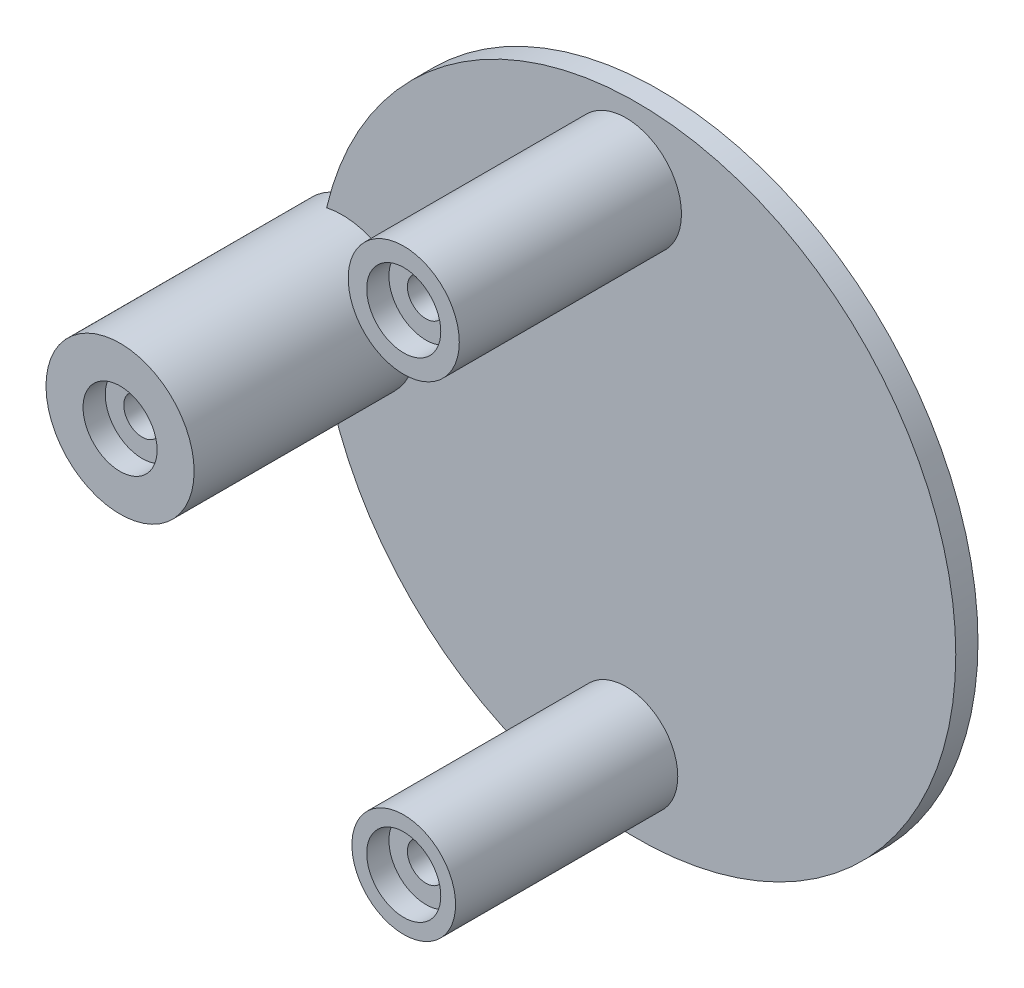
ISO-10303-21;
HEADER;
FILE_DESCRIPTION(('STEP AP214'),'2;1');
FILE_NAME('part.step','',(''),(''),'','','');
FILE_SCHEMA(('AUTOMOTIVE_DESIGN { 1 0 10303 214 1 1 1 1 }'));
ENDSEC;
DATA;
#1=APPLICATION_CONTEXT('core data for automotive mechanical design processes');
#2=APPLICATION_PROTOCOL_DEFINITION('international standard','automotive_design',2000,#1);
#3=PRODUCT_CONTEXT('',#1,'mechanical');
#4=PRODUCT('Part','Part','',(#3));
#5=PRODUCT_RELATED_PRODUCT_CATEGORY('part','',(#4));
#6=PRODUCT_DEFINITION_FORMATION('','',#4);
#7=PRODUCT_DEFINITION_CONTEXT('part definition',#1,'design');
#8=PRODUCT_DEFINITION('design','',#6,#7);
#9=PRODUCT_DEFINITION_SHAPE('','',#8);
#10=(LENGTH_UNIT() NAMED_UNIT(*) SI_UNIT(.MILLI.,.METRE.));
#11=(NAMED_UNIT(*) PLANE_ANGLE_UNIT() SI_UNIT($,.RADIAN.));
#12=(NAMED_UNIT(*) SI_UNIT($,.STERADIAN.) SOLID_ANGLE_UNIT());
#13=UNCERTAINTY_MEASURE_WITH_UNIT(LENGTH_MEASURE(1.E-05),#10,'distance_accuracy_value','');
#14=(GEOMETRIC_REPRESENTATION_CONTEXT(3) GLOBAL_UNCERTAINTY_ASSIGNED_CONTEXT((#13)) GLOBAL_UNIT_ASSIGNED_CONTEXT((#10,
#11,#12)) REPRESENTATION_CONTEXT('',''));
#15=CARTESIAN_POINT('',(0.,0.,0.));
#16=DIRECTION('',(0.,0.,1.));
#17=DIRECTION('',(1.,0.,0.));
#18=AXIS2_PLACEMENT_3D('',#15,#16,#17);
#19=CARTESIAN_POINT('',(29.,78.,0.));
#20=DIRECTION('',(0.,0.,-1.));
#21=DIRECTION('',(1.,0.,0.));
#22=AXIS2_PLACEMENT_3D('',#19,#20,#21);
#23=PLANE('',#22);
#24=CARTESIAN_POINT('',(29.,78.,0.));
#25=DIRECTION('',(0.,0.,1.));
#26=DIRECTION('',(1.,0.,0.));
#27=AXIS2_PLACEMENT_3D('',#24,#25,#26);
#28=CIRCLE('',#27,7.5);
#29=CARTESIAN_POINT('',(36.5,78.,0.));
#30=VERTEX_POINT('',#29);
#31=EDGE_CURVE('E79',#30,#30,#28,.T.);
#32=ORIENTED_EDGE('',*,*,#31,.T.);
#33=EDGE_LOOP('',(#32));
#34=FACE_BOUND('',#33,.T.);
#35=CARTESIAN_POINT('',(29.,78.,0.));
#36=DIRECTION('',(0.,0.,1.));
#37=DIRECTION('',(1.,0.,0.));
#38=AXIS2_PLACEMENT_3D('',#35,#36,#37);
#39=CIRCLE('',#38,5.);
#40=CARTESIAN_POINT('',(34.,78.,0.));
#41=VERTEX_POINT('',#40);
#42=EDGE_CURVE('E92',#41,#41,#39,.T.);
#43=ORIENTED_EDGE('',*,*,#42,.F.);
#44=EDGE_LOOP('',(#43));
#45=FACE_BOUND('',#44,.T.);
#46=ADVANCED_FACE('F37',(#34,#45),#23,.F.);
#47=CARTESIAN_POINT('',(29.,78.,-3.));
#48=DIRECTION('',(0.,0.,1.));
#49=DIRECTION('',(-1.,0.,0.));
#50=AXIS2_PLACEMENT_3D('',#47,#48,#49);
#51=CYLINDRICAL_SURFACE('',#50,7.5);
#52=ORIENTED_EDGE('',*,*,#31,.F.);
#53=EDGE_LOOP('',(#52));
#54=FACE_BOUND('',#53,.T.);
#55=CARTESIAN_POINT('',(29.,78.,-30.));
#56=DIRECTION('',(0.,0.,1.));
#57=DIRECTION('',(1.,0.,0.));
#58=AXIS2_PLACEMENT_3D('',#55,#56,#57);
#59=CIRCLE('',#58,7.5);
#60=CARTESIAN_POINT('',(36.5,78.,-30.));
#61=VERTEX_POINT('',#60);
#62=EDGE_CURVE('E83',#61,#61,#59,.T.);
#63=ORIENTED_EDGE('',*,*,#62,.T.);
#64=EDGE_LOOP('',(#63));
#65=FACE_BOUND('',#64,.T.);
#66=ADVANCED_FACE('F39',(#54,#65),#51,.T.);
#67=CARTESIAN_POINT('',(29.,78.,-3.));
#68=DIRECTION('',(0.,0.,1.));
#69=DIRECTION('',(-1.,0.,0.));
#70=AXIS2_PLACEMENT_3D('',#67,#68,#69);
#71=CYLINDRICAL_SURFACE('',#70,5.);
#72=CARTESIAN_POINT('',(29.,78.,-3.));
#73=DIRECTION('',(0.,0.,1.));
#74=DIRECTION('',(1.,0.,0.));
#75=AXIS2_PLACEMENT_3D('',#72,#73,#74);
#76=CIRCLE('',#75,5.);
#77=CARTESIAN_POINT('',(34.,78.,-3.));
#78=VERTEX_POINT('',#77);
#79=EDGE_CURVE('E89',#78,#78,#76,.T.);
#80=ORIENTED_EDGE('',*,*,#79,.F.);
#81=EDGE_LOOP('',(#80));
#82=FACE_BOUND('',#81,.T.);
#83=ORIENTED_EDGE('',*,*,#42,.T.);
#84=EDGE_LOOP('',(#83));
#85=FACE_BOUND('',#84,.T.);
#86=ADVANCED_FACE('F152',(#82,#85),#71,.F.);
#87=CARTESIAN_POINT('',(29.,78.,-3.));
#88=DIRECTION('',(0.,0.,-1.));
#89=DIRECTION('',(1.,0.,0.));
#90=AXIS2_PLACEMENT_3D('',#87,#88,#89);
#91=PLANE('',#90);
#92=CARTESIAN_POINT('',(29.,78.,-3.));
#93=DIRECTION('',(0.,0.,1.));
#94=DIRECTION('',(1.,0.,0.));
#95=AXIS2_PLACEMENT_3D('',#92,#93,#94);
#96=CIRCLE('',#95,2.5);
#97=CARTESIAN_POINT('',(31.5,78.,-3.));
#98=VERTEX_POINT('',#97);
#99=EDGE_CURVE('E102',#98,#98,#96,.T.);
#100=ORIENTED_EDGE('',*,*,#99,.F.);
#101=EDGE_LOOP('',(#100));
#102=FACE_BOUND('',#101,.T.);
#103=ORIENTED_EDGE('',*,*,#79,.T.);
#104=EDGE_LOOP('',(#103));
#105=FACE_BOUND('',#104,.T.);
#106=ADVANCED_FACE('F158',(#102,#105),#91,.F.);
#107=CARTESIAN_POINT('',(-9.29999999999999,45.,-33.));
#108=DIRECTION('',(0.,0.,1.));
#109=DIRECTION('',(-1.,0.,0.));
#110=AXIS2_PLACEMENT_3D('',#107,#108,#109);
#111=CYLINDRICAL_SURFACE('',#110,10.);
#112=DIRECTION('',(0.,0.,1.));
#113=VECTOR('',#112,1.);
#114=CARTESIAN_POINT('',(-11.4091892759593,54.7750355804048,-33.));
#115=LINE('',#114,#113);
#116=CARTESIAN_POINT('',(-11.4091892759593,54.7750355804048,-33.));
#117=VERTEX_POINT('',#116);
#118=CARTESIAN_POINT('',(-11.4091892759593,54.7750355804048,-30.));
#119=VERTEX_POINT('',#118);
#120=EDGE_CURVE('E77',#117,#119,#115,.T.);
#121=ORIENTED_EDGE('',*,*,#120,.F.);
#122=CARTESIAN_POINT('',(-9.29999999999999,45.,-33.));
#123=DIRECTION('',(0.,0.,1.));
#124=DIRECTION('',(1.,0.,0.));
#125=AXIS2_PLACEMENT_3D('',#122,#123,#124);
#126=CIRCLE('',#125,10.);
#127=CARTESIAN_POINT('',(-11.4091892759592,35.2249644195953,-33.));
#128=VERTEX_POINT('',#127);
#129=EDGE_CURVE('E69',#117,#128,#126,.T.);
#130=ORIENTED_EDGE('',*,*,#129,.T.);
#131=DIRECTION('',(0.,0.,1.));
#132=VECTOR('',#131,1.);
#133=CARTESIAN_POINT('',(-11.4091892759592,35.2249644195953,-33.));
#134=LINE('',#133,#132);
#135=CARTESIAN_POINT('',(-11.4091892759592,35.2249644195953,-30.));
#136=VERTEX_POINT('',#135);
#137=EDGE_CURVE('E78',#128,#136,#134,.T.);
#138=ORIENTED_EDGE('',*,*,#137,.T.);
#139=CARTESIAN_POINT('',(-9.29999999999999,45.,-30.));
#140=DIRECTION('',(0.,0.,1.));
#141=DIRECTION('',(1.,0.,0.));
#142=AXIS2_PLACEMENT_3D('',#139,#140,#141);
#143=CIRCLE('',#142,9.99999999999999);
#144=EDGE_CURVE('E47',#119,#136,#143,.F.);
#145=ORIENTED_EDGE('',*,*,#144,.F.);
#146=EDGE_LOOP('',(#121,#130,#138,#145));
#147=FACE_BOUND('',#146,.T.);
#148=CARTESIAN_POINT('',(-9.29999999999999,45.,0.));
#149=DIRECTION('',(0.,0.,1.));
#150=DIRECTION('',(1.,0.,0.));
#151=AXIS2_PLACEMENT_3D('',#148,#149,#150);
#152=CIRCLE('',#151,9.99999999999999);
#153=CARTESIAN_POINT('',(0.700000000000004,45.,0.));
#154=VERTEX_POINT('',#153);
#155=EDGE_CURVE('E70',#154,#154,#152,.T.);
#156=ORIENTED_EDGE('',*,*,#155,.F.);
#157=EDGE_LOOP('',(#156));
#158=FACE_BOUND('',#157,.T.);
#159=ADVANCED_FACE('F74',(#147,#158),#111,.T.);
#160=CARTESIAN_POINT('',(30.5,45.,-33.));
#161=DIRECTION('',(0.,0.,1.));
#162=DIRECTION('',(-1.,0.,0.));
#163=AXIS2_PLACEMENT_3D('',#160,#161,#162);
#164=CYLINDRICAL_SURFACE('',#163,43.0340733183179);
#165=CARTESIAN_POINT('',(30.5,45.,-30.));
#166=DIRECTION('',(0.,0.,1.));
#167=DIRECTION('',(1.,0.,0.));
#168=AXIS2_PLACEMENT_3D('',#165,#166,#167);
#169=CIRCLE('',#168,43.0340733183179);
#170=EDGE_CURVE('E62',#136,#119,#169,.T.);
#171=ORIENTED_EDGE('',*,*,#170,.F.);
#172=ORIENTED_EDGE('',*,*,#137,.F.);
#173=CARTESIAN_POINT('',(30.5,45.,-33.));
#174=DIRECTION('',(0.,0.,1.));
#175=DIRECTION('',(1.,0.,0.));
#176=AXIS2_PLACEMENT_3D('',#173,#174,#175);
#177=CIRCLE('',#176,43.0340733183179);
#178=EDGE_CURVE('E55',#128,#117,#177,.T.);
#179=ORIENTED_EDGE('',*,*,#178,.T.);
#180=ORIENTED_EDGE('',*,*,#120,.T.);
#181=EDGE_LOOP('',(#171,#172,#179,#180));
#182=FACE_BOUND('',#181,.T.);
#183=ADVANCED_FACE('F81',(#182),#164,.T.);
#184=CARTESIAN_POINT('',(10.6,45.,-33.));
#185=DIRECTION('',(0.,0.,-1.));
#186=DIRECTION('',(1.,0.,0.));
#187=AXIS2_PLACEMENT_3D('',#184,#185,#186);
#188=PLANE('',#187);
#189=CARTESIAN_POINT('',(-9.29999999999999,45.,-33.));
#190=DIRECTION('',(0.,0.,1.));
#191=DIRECTION('',(1.,0.,0.));
#192=AXIS2_PLACEMENT_3D('',#189,#190,#191);
#193=CIRCLE('',#192,2.5);
#194=CARTESIAN_POINT('',(-6.79999999999999,45.,-33.));
#195=VERTEX_POINT('',#194);
#196=EDGE_CURVE('E98',#195,#195,#193,.T.);
#197=ORIENTED_EDGE('',*,*,#196,.T.);
#198=EDGE_LOOP('',(#197));
#199=FACE_BOUND('',#198,.T.);
#200=CARTESIAN_POINT('',(29.,12.,-33.));
#201=DIRECTION('',(0.,0.,1.));
#202=DIRECTION('',(1.,0.,0.));
#203=AXIS2_PLACEMENT_3D('',#200,#201,#202);
#204=CIRCLE('',#203,2.5);
#205=CARTESIAN_POINT('',(31.5,12.,-33.));
#206=VERTEX_POINT('',#205);
#207=EDGE_CURVE('E104',#206,#206,#204,.T.);
#208=ORIENTED_EDGE('',*,*,#207,.T.);
#209=EDGE_LOOP('',(#208));
#210=FACE_BOUND('',#209,.T.);
#211=CARTESIAN_POINT('',(29.,78.,-33.));
#212=DIRECTION('',(0.,0.,1.));
#213=DIRECTION('',(1.,0.,0.));
#214=AXIS2_PLACEMENT_3D('',#211,#212,#213);
#215=CIRCLE('',#214,2.5);
#216=CARTESIAN_POINT('',(31.5,78.,-33.));
#217=VERTEX_POINT('',#216);
#218=EDGE_CURVE('E109',#217,#217,#215,.T.);
#219=ORIENTED_EDGE('',*,*,#218,.T.);
#220=EDGE_LOOP('',(#219));
#221=FACE_BOUND('',#220,.T.);
#222=ORIENTED_EDGE('',*,*,#129,.F.);
#223=ORIENTED_EDGE('',*,*,#178,.F.);
#224=EDGE_LOOP('',(#222,#223));
#225=FACE_BOUND('',#224,.T.);
#226=ADVANCED_FACE('F134',(#199,#210,#221,#225),#188,.T.);
#227=CARTESIAN_POINT('',(10.6,45.,-30.));
#228=DIRECTION('',(0.,0.,-1.));
#229=DIRECTION('',(1.,0.,0.));
#230=AXIS2_PLACEMENT_3D('',#227,#228,#229);
#231=PLANE('',#230);
#232=CARTESIAN_POINT('',(29.,12.,-30.));
#233=DIRECTION('',(0.,0.,1.));
#234=DIRECTION('',(1.,0.,0.));
#235=AXIS2_PLACEMENT_3D('',#232,#233,#234);
#236=CIRCLE('',#235,7.);
#237=CARTESIAN_POINT('',(36.,12.,-30.));
#238=VERTEX_POINT('',#237);
#239=EDGE_CURVE('E11',#238,#238,#236,.F.);
#240=ORIENTED_EDGE('',*,*,#239,.T.);
#241=EDGE_LOOP('',(#240));
#242=FACE_BOUND('',#241,.T.);
#243=ORIENTED_EDGE('',*,*,#144,.T.);
#244=ORIENTED_EDGE('',*,*,#170,.T.);
#245=EDGE_LOOP('',(#243,#244));
#246=FACE_BOUND('',#245,.T.);
#247=ORIENTED_EDGE('',*,*,#62,.F.);
#248=EDGE_LOOP('',(#247));
#249=FACE_BOUND('',#248,.T.);
#250=ADVANCED_FACE('F66',(#242,#246,#249),#231,.F.);
#251=CARTESIAN_POINT('',(-9.29999999999999,45.,0.));
#252=DIRECTION('',(0.,0.,-1.));
#253=DIRECTION('',(1.,0.,0.));
#254=AXIS2_PLACEMENT_3D('',#251,#252,#253);
#255=PLANE('',#254);
#256=ORIENTED_EDGE('',*,*,#155,.T.);
#257=EDGE_LOOP('',(#256));
#258=FACE_BOUND('',#257,.T.);
#259=CARTESIAN_POINT('',(-9.29999999999999,45.,0.));
#260=DIRECTION('',(0.,0.,1.));
#261=DIRECTION('',(1.,0.,0.));
#262=AXIS2_PLACEMENT_3D('',#259,#260,#261);
#263=CIRCLE('',#262,5.);
#264=CARTESIAN_POINT('',(-4.29999999999999,45.,0.));
#265=VERTEX_POINT('',#264);
#266=EDGE_CURVE('E128',#265,#265,#263,.T.);
#267=ORIENTED_EDGE('',*,*,#266,.F.);
#268=EDGE_LOOP('',(#267));
#269=FACE_BOUND('',#268,.T.);
#270=ADVANCED_FACE('F141',(#258,#269),#255,.F.);
#271=CARTESIAN_POINT('',(-9.29999999999999,45.,-3.));
#272=DIRECTION('',(0.,0.,1.));
#273=DIRECTION('',(-1.,0.,0.));
#274=AXIS2_PLACEMENT_3D('',#271,#272,#273);
#275=CYLINDRICAL_SURFACE('',#274,5.);
#276=CARTESIAN_POINT('',(-9.29999999999999,45.,-3.));
#277=DIRECTION('',(0.,0.,1.));
#278=DIRECTION('',(1.,0.,0.));
#279=AXIS2_PLACEMENT_3D('',#276,#277,#278);
#280=CIRCLE('',#279,5.);
#281=CARTESIAN_POINT('',(-4.29999999999999,45.,-3.));
#282=VERTEX_POINT('',#281);
#283=EDGE_CURVE('E125',#282,#282,#280,.T.);
#284=ORIENTED_EDGE('',*,*,#283,.F.);
#285=EDGE_LOOP('',(#284));
#286=FACE_BOUND('',#285,.T.);
#287=ORIENTED_EDGE('',*,*,#266,.T.);
#288=EDGE_LOOP('',(#287));
#289=FACE_BOUND('',#288,.T.);
#290=ADVANCED_FACE('F191',(#286,#289),#275,.F.);
#291=CARTESIAN_POINT('',(-9.29999999999999,45.,-3.));
#292=DIRECTION('',(0.,0.,-1.));
#293=DIRECTION('',(1.,0.,0.));
#294=AXIS2_PLACEMENT_3D('',#291,#292,#293);
#295=PLANE('',#294);
#296=CARTESIAN_POINT('',(-9.29999999999999,45.,-3.));
#297=DIRECTION('',(0.,0.,1.));
#298=DIRECTION('',(1.,0.,0.));
#299=AXIS2_PLACEMENT_3D('',#296,#297,#298);
#300=CIRCLE('',#299,2.5);
#301=CARTESIAN_POINT('',(-6.79999999999999,45.,-3.));
#302=VERTEX_POINT('',#301);
#303=EDGE_CURVE('E41',#302,#302,#300,.T.);
#304=ORIENTED_EDGE('',*,*,#303,.F.);
#305=EDGE_LOOP('',(#304));
#306=FACE_BOUND('',#305,.T.);
#307=ORIENTED_EDGE('',*,*,#283,.T.);
#308=EDGE_LOOP('',(#307));
#309=FACE_BOUND('',#308,.T.);
#310=ADVANCED_FACE('F200',(#306,#309),#295,.F.);
#311=CARTESIAN_POINT('',(29.,12.,0.));
#312=DIRECTION('',(0.,0.,-1.));
#313=DIRECTION('',(1.,0.,0.));
#314=AXIS2_PLACEMENT_3D('',#311,#312,#313);
#315=PLANE('',#314);
#316=CARTESIAN_POINT('',(29.,12.,0.));
#317=DIRECTION('',(0.,0.,1.));
#318=DIRECTION('',(1.,0.,0.));
#319=AXIS2_PLACEMENT_3D('',#316,#317,#318);
#320=CIRCLE('',#319,7.);
#321=CARTESIAN_POINT('',(36.,12.,0.));
#322=VERTEX_POINT('',#321);
#323=EDGE_CURVE('E122',#322,#322,#320,.T.);
#324=ORIENTED_EDGE('',*,*,#323,.T.);
#325=EDGE_LOOP('',(#324));
#326=FACE_BOUND('',#325,.T.);
#327=CARTESIAN_POINT('',(29.,12.,0.));
#328=DIRECTION('',(0.,0.,1.));
#329=DIRECTION('',(1.,0.,0.));
#330=AXIS2_PLACEMENT_3D('',#327,#328,#329);
#331=CIRCLE('',#330,5.);
#332=CARTESIAN_POINT('',(34.,12.,0.));
#333=VERTEX_POINT('',#332);
#334=EDGE_CURVE('E119',#333,#333,#331,.T.);
#335=ORIENTED_EDGE('',*,*,#334,.F.);
#336=EDGE_LOOP('',(#335));
#337=FACE_BOUND('',#336,.T.);
#338=ADVANCED_FACE('F210',(#326,#337),#315,.F.);
#339=CARTESIAN_POINT('',(29.,12.,-3.));
#340=DIRECTION('',(0.,0.,1.));
#341=DIRECTION('',(-1.,0.,0.));
#342=AXIS2_PLACEMENT_3D('',#339,#340,#341);
#343=CYLINDRICAL_SURFACE('',#342,7.);
#344=ORIENTED_EDGE('',*,*,#323,.F.);
#345=EDGE_LOOP('',(#344));
#346=FACE_BOUND('',#345,.T.);
#347=ORIENTED_EDGE('',*,*,#239,.F.);
#348=EDGE_LOOP('',(#347));
#349=FACE_BOUND('',#348,.T.);
#350=ADVANCED_FACE('F220',(#346,#349),#343,.T.);
#351=CARTESIAN_POINT('',(29.,12.,-3.));
#352=DIRECTION('',(0.,0.,1.));
#353=DIRECTION('',(-1.,0.,0.));
#354=AXIS2_PLACEMENT_3D('',#351,#352,#353);
#355=CYLINDRICAL_SURFACE('',#354,5.);
#356=CARTESIAN_POINT('',(29.,12.,-3.));
#357=DIRECTION('',(0.,0.,1.));
#358=DIRECTION('',(1.,0.,0.));
#359=AXIS2_PLACEMENT_3D('',#356,#357,#358);
#360=CIRCLE('',#359,5.);
#361=CARTESIAN_POINT('',(34.,12.,-3.));
#362=VERTEX_POINT('',#361);
#363=EDGE_CURVE('E116',#362,#362,#360,.T.);
#364=ORIENTED_EDGE('',*,*,#363,.F.);
#365=EDGE_LOOP('',(#364));
#366=FACE_BOUND('',#365,.T.);
#367=ORIENTED_EDGE('',*,*,#334,.T.);
#368=EDGE_LOOP('',(#367));
#369=FACE_BOUND('',#368,.T.);
#370=ADVANCED_FACE('F231',(#366,#369),#355,.F.);
#371=CARTESIAN_POINT('',(29.,12.,-3.));
#372=DIRECTION('',(0.,0.,-1.));
#373=DIRECTION('',(1.,0.,0.));
#374=AXIS2_PLACEMENT_3D('',#371,#372,#373);
#375=PLANE('',#374);
#376=CARTESIAN_POINT('',(29.,12.,-3.));
#377=DIRECTION('',(0.,0.,1.));
#378=DIRECTION('',(1.,0.,0.));
#379=AXIS2_PLACEMENT_3D('',#376,#377,#378);
#380=CIRCLE('',#379,2.5);
#381=CARTESIAN_POINT('',(31.5,12.,-3.));
#382=VERTEX_POINT('',#381);
#383=EDGE_CURVE('E96',#382,#382,#380,.T.);
#384=ORIENTED_EDGE('',*,*,#383,.F.);
#385=EDGE_LOOP('',(#384));
#386=FACE_BOUND('',#385,.T.);
#387=ORIENTED_EDGE('',*,*,#363,.T.);
#388=EDGE_LOOP('',(#387));
#389=FACE_BOUND('',#388,.T.);
#390=ADVANCED_FACE('F241',(#386,#389),#375,.F.);
#391=CARTESIAN_POINT('',(29.,12.,0.));
#392=DIRECTION('',(0.,0.,-1.));
#393=DIRECTION('',(1.,0.,0.));
#394=AXIS2_PLACEMENT_3D('',#391,#392,#393);
#395=CYLINDRICAL_SURFACE('',#394,2.5);
#396=ORIENTED_EDGE('',*,*,#207,.F.);
#397=EDGE_LOOP('',(#396));
#398=FACE_BOUND('',#397,.T.);
#399=ORIENTED_EDGE('',*,*,#383,.T.);
#400=EDGE_LOOP('',(#399));
#401=FACE_BOUND('',#400,.T.);
#402=ADVANCED_FACE('F251',(#398,#401),#395,.F.);
#403=CARTESIAN_POINT('',(-9.29999999999999,45.,0.));
#404=DIRECTION('',(0.,0.,-1.));
#405=DIRECTION('',(1.,0.,0.));
#406=AXIS2_PLACEMENT_3D('',#403,#404,#405);
#407=CYLINDRICAL_SURFACE('',#406,2.5);
#408=ORIENTED_EDGE('',*,*,#196,.F.);
#409=EDGE_LOOP('',(#408));
#410=FACE_BOUND('',#409,.T.);
#411=ORIENTED_EDGE('',*,*,#303,.T.);
#412=EDGE_LOOP('',(#411));
#413=FACE_BOUND('',#412,.T.);
#414=ADVANCED_FACE('F261',(#410,#413),#407,.F.);
#415=CARTESIAN_POINT('',(29.,78.,0.));
#416=DIRECTION('',(0.,0.,-1.));
#417=DIRECTION('',(1.,0.,0.));
#418=AXIS2_PLACEMENT_3D('',#415,#416,#417);
#419=CYLINDRICAL_SURFACE('',#418,2.5);
#420=ORIENTED_EDGE('',*,*,#218,.F.);
#421=EDGE_LOOP('',(#420));
#422=FACE_BOUND('',#421,.T.);
#423=ORIENTED_EDGE('',*,*,#99,.T.);
#424=EDGE_LOOP('',(#423));
#425=FACE_BOUND('',#424,.T.);
#426=ADVANCED_FACE('F271',(#422,#425),#419,.F.);
#427=CLOSED_SHELL('',(#46,#66,#86,#106,#159,#183,#226,#250,#270,#290,#310,#338,#350,#370,#390,
#402,#414,#426));
#428=MANIFOLD_SOLID_BREP('B2',#427);
#429=ADVANCED_BREP_SHAPE_REPRESENTATION('',(#18,#428),#14);
#430=SHAPE_DEFINITION_REPRESENTATION(#9,#429);
ENDSEC;
END-ISO-10303-21;
